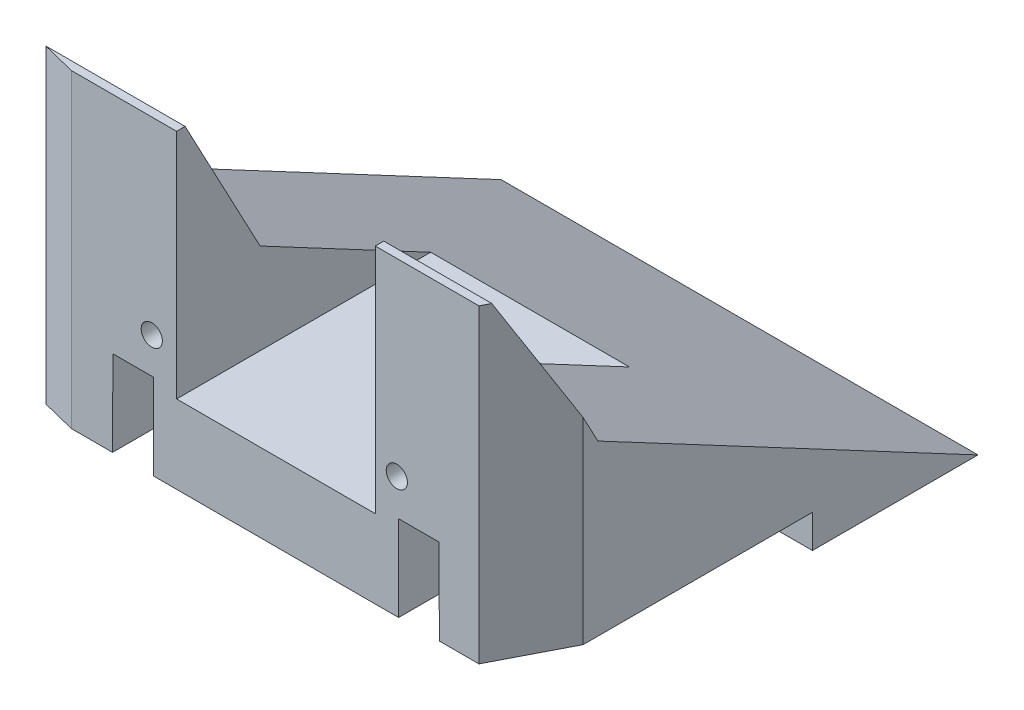
ISO-10303-21;
HEADER;
FILE_DESCRIPTION(('STEP AP214'),'2;1');
FILE_NAME('part.step','',(''),(''),'','','');
FILE_SCHEMA(('AUTOMOTIVE_DESIGN { 1 0 10303 214 1 1 1 1 }'));
ENDSEC;
DATA;
#1=APPLICATION_CONTEXT('core data for automotive mechanical design processes');
#2=APPLICATION_PROTOCOL_DEFINITION('international standard','automotive_design',2000,#1);
#3=PRODUCT_CONTEXT('',#1,'mechanical');
#4=PRODUCT('Part','Part','',(#3));
#5=PRODUCT_RELATED_PRODUCT_CATEGORY('part','',(#4));
#6=PRODUCT_DEFINITION_FORMATION('','',#4);
#7=PRODUCT_DEFINITION_CONTEXT('part definition',#1,'design');
#8=PRODUCT_DEFINITION('design','',#6,#7);
#9=PRODUCT_DEFINITION_SHAPE('','',#8);
#10=(LENGTH_UNIT() NAMED_UNIT(*) SI_UNIT(.MILLI.,.METRE.));
#11=(NAMED_UNIT(*) PLANE_ANGLE_UNIT() SI_UNIT($,.RADIAN.));
#12=(NAMED_UNIT(*) SI_UNIT($,.STERADIAN.) SOLID_ANGLE_UNIT());
#13=UNCERTAINTY_MEASURE_WITH_UNIT(LENGTH_MEASURE(1.E-05),#10,'distance_accuracy_value','');
#14=(GEOMETRIC_REPRESENTATION_CONTEXT(3) GLOBAL_UNCERTAINTY_ASSIGNED_CONTEXT((#13)) GLOBAL_UNIT_ASSIGNED_CONTEXT((#10,
#11,#12)) REPRESENTATION_CONTEXT('',''));
#15=CARTESIAN_POINT('',(0.,0.,0.));
#16=DIRECTION('',(0.,0.,1.));
#17=DIRECTION('',(1.,0.,0.));
#18=AXIS2_PLACEMENT_3D('',#15,#16,#17);
#19=CARTESIAN_POINT('',(72.,51.82,0.));
#20=DIRECTION('',(0.,-1.,0.));
#21=DIRECTION('',(0.,0.,-1.));
#22=AXIS2_PLACEMENT_3D('',#19,#20,#21);
#23=PLANE('',#22);
#24=DIRECTION('',(-1.,0.,0.));
#25=VECTOR('',#24,1.);
#26=CARTESIAN_POINT('',(72.,51.82,0.));
#27=LINE('',#26,#25);
#28=CARTESIAN_POINT('',(66.648328853148,51.82,0.));
#29=VERTEX_POINT('',#28);
#30=CARTESIAN_POINT('',(51.,51.82,0.));
#31=VERTEX_POINT('',#30);
#32=EDGE_CURVE('E411',#29,#31,#27,.T.);
#33=ORIENTED_EDGE('',*,*,#32,.F.);
#34=DIRECTION('',(-0.458155006495583,0.,0.88887231367786));
#35=VECTOR('',#34,1.);
#36=CARTESIAN_POINT('',(66.648328853148,51.82,0.));
#37=LINE('',#36,#35);
#38=CARTESIAN_POINT('',(67.3084366509914,51.82,-1.28068347442915));
#39=VERTEX_POINT('',#38);
#40=EDGE_CURVE('E325',#39,#29,#37,.T.);
#41=ORIENTED_EDGE('',*,*,#40,.F.);
#42=DIRECTION('',(1.,0.,0.));
#43=VECTOR('',#42,1.);
#44=CARTESIAN_POINT('',(0.,51.82,-1.28068347442915));
#45=LINE('',#44,#43);
#46=CARTESIAN_POINT('',(51.,51.82,-1.28068347442915));
#47=VERTEX_POINT('',#46);
#48=EDGE_CURVE('E403',#47,#39,#45,.T.);
#49=ORIENTED_EDGE('',*,*,#48,.F.);
#50=DIRECTION('',(0.,0.,-1.));
#51=VECTOR('',#50,1.);
#52=CARTESIAN_POINT('',(51.,51.82,0.));
#53=LINE('',#52,#51);
#54=EDGE_CURVE('E359',#31,#47,#53,.T.);
#55=ORIENTED_EDGE('',*,*,#54,.F.);
#56=EDGE_LOOP('',(#33,#41,#49,#55));
#57=FACE_BOUND('',#56,.T.);
#58=ADVANCED_FACE('F33',(#57),#23,.F.);
#59=CARTESIAN_POINT('',(0.,30.515651581083,-12.6084064641698));
#60=DIRECTION('',(0.,-0.469471562785895,0.882947592858924));
#61=DIRECTION('',(0.,-0.882947592858925,-0.469471562785895));
#62=AXIS2_PLACEMENT_3D('',#59,#60,#61);
#63=PLANE('',#62);
#64=ORIENTED_EDGE('',*,*,#48,.T.);
#65=DIRECTION('',(-0.235193662382154,0.858179613223027,0.456302194410289));
#66=VECTOR('',#65,1.);
#67=CARTESIAN_POINT('',(77.5939479758121,14.2900085829974,-21.235733881024));
#68=LINE('',#67,#66);
#69=CARTESIAN_POINT('',(72.,34.7013243542187,-10.3828447728448));
#70=VERTEX_POINT('',#69);
#71=EDGE_CURVE('E315',#70,#39,#68,.T.);
#72=ORIENTED_EDGE('',*,*,#71,.F.);
#73=DIRECTION('',(0.,-0.882947592858925,-0.469471562785895));
#74=VECTOR('',#73,1.);
#75=CARTESIAN_POINT('',(72.,30.515651581083,-12.6084064641698));
#76=LINE('',#75,#74);
#77=CARTESIAN_POINT('',(72.,30.515651581083,-12.6084064641698));
#78=VERTEX_POINT('',#77);
#79=EDGE_CURVE('E387',#70,#78,#76,.T.);
#80=ORIENTED_EDGE('',*,*,#79,.T.);
#81=DIRECTION('',(1.,0.,0.));
#82=VECTOR('',#81,1.);
#83=CARTESIAN_POINT('',(0.,30.515651581083,-12.6084064641698));
#84=LINE('',#83,#82);
#85=CARTESIAN_POINT('',(51.,30.515651581083,-12.6084064641698));
#86=VERTEX_POINT('',#85);
#87=EDGE_CURVE('E395',#86,#78,#84,.T.);
#88=ORIENTED_EDGE('',*,*,#87,.F.);
#89=DIRECTION('',(0.,0.882947592858925,0.469471562785895));
#90=VECTOR('',#89,1.);
#91=CARTESIAN_POINT('',(51.,30.515651581083,-12.6084064641698));
#92=LINE('',#91,#90);
#93=EDGE_CURVE('E384',#86,#47,#92,.T.);
#94=ORIENTED_EDGE('',*,*,#93,.T.);
#95=EDGE_LOOP('',(#64,#72,#80,#88,#94));
#96=FACE_BOUND('',#95,.T.);
#97=ADVANCED_FACE('F487',(#96),#63,.F.);
#98=CARTESIAN_POINT('',(72.,0.,0.));
#99=DIRECTION('',(0.,0.,-1.));
#100=DIRECTION('',(-1.,0.,0.));
#101=AXIS2_PLACEMENT_3D('',#98,#99,#100);
#102=PLANE('',#101);
#103=CARTESIAN_POINT('',(17.2500000000013,23.320000000001,0.));
#104=DIRECTION('',(0.,0.,1.));
#105=DIRECTION('',(1.,0.,0.));
#106=AXIS2_PLACEMENT_3D('',#103,#104,#105);
#107=CIRCLE('',#106,1.6);
#108=CARTESIAN_POINT('',(18.8500000000013,23.320000000001,0.));
#109=VERTEX_POINT('',#108);
#110=EDGE_CURVE('E316',#109,#109,#107,.T.);
#111=ORIENTED_EDGE('',*,*,#110,.F.);
#112=EDGE_LOOP('',(#111));
#113=FACE_BOUND('',#112,.T.);
#114=CARTESIAN_POINT('',(54.2500000000013,23.3200000000008,0.));
#115=DIRECTION('',(0.,0.,1.));
#116=DIRECTION('',(1.,0.,0.));
#117=AXIS2_PLACEMENT_3D('',#114,#115,#116);
#118=CIRCLE('',#117,1.6);
#119=CARTESIAN_POINT('',(55.8500000000013,23.3200000000008,0.));
#120=VERTEX_POINT('',#119);
#121=EDGE_CURVE('E309',#120,#120,#118,.T.);
#122=ORIENTED_EDGE('',*,*,#121,.F.);
#123=EDGE_LOOP('',(#122));
#124=FACE_BOUND('',#123,.T.);
#125=DIRECTION('',(-1.,0.,0.));
#126=VECTOR('',#125,1.);
#127=CARTESIAN_POINT('',(54.521671146852,17.92,0.));
#128=LINE('',#127,#126);
#129=CARTESIAN_POINT('',(60.621671146852,17.92,0.));
#130=VERTEX_POINT('',#129);
#131=CARTESIAN_POINT('',(54.521671146852,17.92,0.));
#132=VERTEX_POINT('',#131);
#133=EDGE_CURVE('E232',#130,#132,#128,.T.);
#134=ORIENTED_EDGE('',*,*,#133,.F.);
#135=DIRECTION('',(-0.00386994006096731,0.999992511753925,0.));
#136=VECTOR('',#135,1.);
#137=CARTESIAN_POINT('',(60.621671146852,17.92,0.));
#138=LINE('',#137,#136);
#139=CARTESIAN_POINT('',(60.671671146852,5.,0.));
#140=VERTEX_POINT('',#139);
#141=EDGE_CURVE('E217',#140,#130,#138,.T.);
#142=ORIENTED_EDGE('',*,*,#141,.F.);
#143=DIRECTION('',(1.,0.,0.));
#144=VECTOR('',#143,1.);
#145=CARTESIAN_POINT('',(-0.001000000000001,5.,0.));
#146=LINE('',#145,#144);
#147=CARTESIAN_POINT('',(66.648328853148,5.,0.));
#148=VERTEX_POINT('',#147);
#149=EDGE_CURVE('E361',#140,#148,#146,.T.);
#150=ORIENTED_EDGE('',*,*,#149,.T.);
#151=DIRECTION('',(0.,1.,0.));
#152=VECTOR('',#151,1.);
#153=CARTESIAN_POINT('',(66.648328853148,-0.001000000000001,0.));
#154=LINE('',#153,#152);
#155=EDGE_CURVE('E328',#148,#29,#154,.T.);
#156=ORIENTED_EDGE('',*,*,#155,.T.);
#157=ORIENTED_EDGE('',*,*,#32,.T.);
#158=DIRECTION('',(0.,1.,0.));
#159=VECTOR('',#158,1.);
#160=CARTESIAN_POINT('',(51.,16.82,0.));
#161=LINE('',#160,#159);
#162=CARTESIAN_POINT('',(51.,16.82,0.));
#163=VERTEX_POINT('',#162);
#164=EDGE_CURVE('E376',#163,#31,#161,.T.);
#165=ORIENTED_EDGE('',*,*,#164,.F.);
#166=DIRECTION('',(1.,0.,0.));
#167=VECTOR('',#166,1.);
#168=CARTESIAN_POINT('',(51.,16.82,0.));
#169=LINE('',#168,#167);
#170=CARTESIAN_POINT('',(21.,16.82,0.));
#171=VERTEX_POINT('',#170);
#172=EDGE_CURVE('E370',#171,#163,#169,.T.);
#173=ORIENTED_EDGE('',*,*,#172,.F.);
#174=DIRECTION('',(0.,1.,0.));
#175=VECTOR('',#174,1.);
#176=CARTESIAN_POINT('',(21.,16.82,0.));
#177=LINE('',#176,#175);
#178=CARTESIAN_POINT('',(21.,51.82,0.));
#179=VERTEX_POINT('',#178);
#180=EDGE_CURVE('E373',#171,#179,#177,.T.);
#181=ORIENTED_EDGE('',*,*,#180,.T.);
#182=CARTESIAN_POINT('',(5.10343225958013,51.82,0.));
#183=VERTEX_POINT('',#182);
#184=EDGE_CURVE('E409',#179,#183,#27,.T.);
#185=ORIENTED_EDGE('',*,*,#184,.T.);
#186=DIRECTION('',(0.,1.,0.));
#187=VECTOR('',#186,1.);
#188=CARTESIAN_POINT('',(5.10343225958013,-0.001000000000001,0.));
#189=LINE('',#188,#187);
#190=CARTESIAN_POINT('',(5.10343225958013,5.,0.));
#191=VERTEX_POINT('',#190);
#192=EDGE_CURVE('E338',#191,#183,#189,.T.);
#193=ORIENTED_EDGE('',*,*,#192,.F.);
#194=CARTESIAN_POINT('',(11.328328853148,5.,0.));
#195=VERTEX_POINT('',#194);
#196=EDGE_CURVE('E356',#191,#195,#146,.T.);
#197=ORIENTED_EDGE('',*,*,#196,.T.);
#198=DIRECTION('',(-0.00386994006096731,-0.999992511753925,0.));
#199=VECTOR('',#198,1.);
#200=CARTESIAN_POINT('',(11.378328853148,17.92,0.));
#201=LINE('',#200,#199);
#202=CARTESIAN_POINT('',(11.378328853148,17.92,0.));
#203=VERTEX_POINT('',#202);
#204=EDGE_CURVE('E246',#203,#195,#201,.T.);
#205=ORIENTED_EDGE('',*,*,#204,.F.);
#206=DIRECTION('',(-1.,0.,0.));
#207=VECTOR('',#206,1.);
#208=CARTESIAN_POINT('',(17.478328853148,17.92,0.));
#209=LINE('',#208,#207);
#210=CARTESIAN_POINT('',(17.478328853148,17.92,0.));
#211=VERTEX_POINT('',#210);
#212=EDGE_CURVE('E255',#211,#203,#209,.T.);
#213=ORIENTED_EDGE('',*,*,#212,.F.);
#214=DIRECTION('',(0.,1.,0.));
#215=VECTOR('',#214,1.);
#216=CARTESIAN_POINT('',(17.478328853148,17.92,0.));
#217=LINE('',#216,#215);
#218=CARTESIAN_POINT('',(17.478328853148,5.,0.));
#219=VERTEX_POINT('',#218);
#220=EDGE_CURVE('E252',#219,#211,#217,.T.);
#221=ORIENTED_EDGE('',*,*,#220,.F.);
#222=CARTESIAN_POINT('',(54.521671146852,5.,0.));
#223=VERTEX_POINT('',#222);
#224=EDGE_CURVE('E360',#219,#223,#146,.T.);
#225=ORIENTED_EDGE('',*,*,#224,.T.);
#226=DIRECTION('',(0.,-1.,0.));
#227=VECTOR('',#226,1.);
#228=CARTESIAN_POINT('',(54.521671146852,17.92,0.));
#229=LINE('',#228,#227);
#230=EDGE_CURVE('E211',#132,#223,#229,.T.);
#231=ORIENTED_EDGE('',*,*,#230,.F.);
#232=EDGE_LOOP('',(#134,#142,#150,#156,#157,#165,#173,#181,#185,#193,#197,#205,#213,#221,#225,#231));
#233=FACE_BOUND('',#232,.T.);
#234=ADVANCED_FACE('F35',(#113,#124,#233),#102,.F.);
#235=CARTESIAN_POINT('',(72.,0.,0.));
#236=DIRECTION('',(0.,1.,0.));
#237=DIRECTION('',(0.,0.,1.));
#238=AXIS2_PLACEMENT_3D('',#235,#236,#237);
#239=PLANE('',#238);
#240=DIRECTION('',(0.,0.,-1.));
#241=VECTOR('',#240,1.);
#242=CARTESIAN_POINT('',(72.,0.,0.));
#243=LINE('',#242,#241);
#244=CARTESIAN_POINT('',(72.,0.,-45.));
#245=VERTEX_POINT('',#244);
#246=CARTESIAN_POINT('',(72.,0.,-70.));
#247=VERTEX_POINT('',#246);
#248=EDGE_CURVE('E407',#245,#247,#243,.T.);
#249=ORIENTED_EDGE('',*,*,#248,.F.);
#250=DIRECTION('',(1.,0.,0.));
#251=VECTOR('',#250,1.);
#252=CARTESIAN_POINT('',(-0.001000000000001,0.,-45.));
#253=LINE('',#252,#251);
#254=CARTESIAN_POINT('',(0.,0.,-45.));
#255=VERTEX_POINT('',#254);
#256=EDGE_CURVE('E355',#255,#245,#253,.T.);
#257=ORIENTED_EDGE('',*,*,#256,.F.);
#258=DIRECTION('',(0.,0.,-1.));
#259=VECTOR('',#258,1.);
#260=CARTESIAN_POINT('',(0.,0.,0.));
#261=LINE('',#260,#259);
#262=CARTESIAN_POINT('',(0.,0.,-70.));
#263=VERTEX_POINT('',#262);
#264=EDGE_CURVE('E402',#255,#263,#261,.T.);
#265=ORIENTED_EDGE('',*,*,#264,.T.);
#266=DIRECTION('',(-1.,0.,0.));
#267=VECTOR('',#266,1.);
#268=CARTESIAN_POINT('',(72.,0.,-70.));
#269=LINE('',#268,#267);
#270=EDGE_CURVE('E413',#247,#263,#269,.T.);
#271=ORIENTED_EDGE('',*,*,#270,.F.);
#272=EDGE_LOOP('',(#249,#257,#265,#271));
#273=FACE_BOUND('',#272,.T.);
#274=ADVANCED_FACE('F471',(#273),#239,.F.);
#275=CARTESIAN_POINT('',(0.,51.82,-1.28068347442915));
#276=VERTEX_POINT('',#275);
#277=CARTESIAN_POINT('',(21.,51.82,-1.28068347442915));
#278=VERTEX_POINT('',#277);
#279=EDGE_CURVE('E399',#276,#278,#45,.T.);
#280=ORIENTED_EDGE('',*,*,#279,.F.);
#281=DIRECTION('',(-0.969926330980672,0.,-0.243398669820464));
#282=VECTOR('',#281,1.);
#283=CARTESIAN_POINT('',(5.10343225958013,51.82,0.));
#284=LINE('',#283,#282);
#285=EDGE_CURVE('E336',#183,#276,#284,.T.);
#286=ORIENTED_EDGE('',*,*,#285,.F.);
#287=ORIENTED_EDGE('',*,*,#184,.F.);
#288=DIRECTION('',(0.,0.,1.));
#289=VECTOR('',#288,1.);
#290=CARTESIAN_POINT('',(21.,51.82,0.));
#291=LINE('',#290,#289);
#292=EDGE_CURVE('E368',#278,#179,#291,.T.);
#293=ORIENTED_EDGE('',*,*,#292,.F.);
#294=EDGE_LOOP('',(#280,#286,#287,#293));
#295=FACE_BOUND('',#294,.T.);
#296=ADVANCED_FACE('F514',(#295),#23,.F.);
#297=CARTESIAN_POINT('',(72.,0.,0.));
#298=DIRECTION('',(-1.,0.,0.));
#299=DIRECTION('',(0.,0.,1.));
#300=AXIS2_PLACEMENT_3D('',#297,#298,#299);
#301=PLANE('',#300);
#302=ORIENTED_EDGE('',*,*,#79,.F.);
#303=DIRECTION('',(0.,1.,0.));
#304=VECTOR('',#303,1.);
#305=CARTESIAN_POINT('',(72.,-0.001000000000001,-10.3828447728448));
#306=LINE('',#305,#304);
#307=CARTESIAN_POINT('',(72.,5.,-10.3828447728448));
#308=VERTEX_POINT('',#307);
#309=EDGE_CURVE('E327',#308,#70,#306,.T.);
#310=ORIENTED_EDGE('',*,*,#309,.F.);
#311=DIRECTION('',(0.,0.,1.));
#312=VECTOR('',#311,1.);
#313=CARTESIAN_POINT('',(72.,5.,0.));
#314=LINE('',#313,#312);
#315=CARTESIAN_POINT('',(72.,5.,-45.));
#316=VERTEX_POINT('',#315);
#317=EDGE_CURVE('E352',#316,#308,#314,.T.);
#318=ORIENTED_EDGE('',*,*,#317,.F.);
#319=DIRECTION('',(0.,1.,0.));
#320=VECTOR('',#319,1.);
#321=CARTESIAN_POINT('',(72.,0.,-45.));
#322=LINE('',#321,#320);
#323=EDGE_CURVE('E349',#245,#316,#322,.T.);
#324=ORIENTED_EDGE('',*,*,#323,.F.);
#325=ORIENTED_EDGE('',*,*,#248,.T.);
#326=DIRECTION('',(0.,-0.469471562785892,-0.882947592858926));
#327=VECTOR('',#326,1.);
#328=CARTESIAN_POINT('',(72.,30.515651581083,-12.6084064641698));
#329=LINE('',#328,#327);
#330=EDGE_CURVE('E392',#78,#247,#329,.T.);
#331=ORIENTED_EDGE('',*,*,#330,.F.);
#332=EDGE_LOOP('',(#302,#310,#318,#324,#325,#331));
#333=FACE_BOUND('',#332,.T.);
#334=ADVANCED_FACE('F476',(#333),#301,.F.);
#335=CARTESIAN_POINT('',(0.,0.,0.));
#336=DIRECTION('',(-1.,0.,0.));
#337=DIRECTION('',(0.,0.,1.));
#338=AXIS2_PLACEMENT_3D('',#335,#336,#337);
#339=PLANE('',#338);
#340=DIRECTION('',(0.,1.,0.));
#341=VECTOR('',#340,1.);
#342=CARTESIAN_POINT('',(0.,-0.001000000000001,-1.28068347442915));
#343=LINE('',#342,#341);
#344=CARTESIAN_POINT('',(0.,5.,-1.28068347442915));
#345=VERTEX_POINT('',#344);
#346=EDGE_CURVE('E339',#345,#276,#343,.T.);
#347=ORIENTED_EDGE('',*,*,#346,.T.);
#348=DIRECTION('',(0.,-0.882947592858925,-0.469471562785895));
#349=VECTOR('',#348,1.);
#350=CARTESIAN_POINT('',(0.,30.515651581083,-12.6084064641698));
#351=LINE('',#350,#349);
#352=CARTESIAN_POINT('',(0.,30.515651581083,-12.6084064641698));
#353=VERTEX_POINT('',#352);
#354=EDGE_CURVE('E388',#276,#353,#351,.T.);
#355=ORIENTED_EDGE('',*,*,#354,.T.);
#356=DIRECTION('',(0.,-0.469471562785892,-0.882947592858926));
#357=VECTOR('',#356,1.);
#358=CARTESIAN_POINT('',(0.,30.515651581083,-12.6084064641698));
#359=LINE('',#358,#357);
#360=EDGE_CURVE('E391',#353,#263,#359,.T.);
#361=ORIENTED_EDGE('',*,*,#360,.T.);
#362=ORIENTED_EDGE('',*,*,#264,.F.);
#363=DIRECTION('',(0.,1.,0.));
#364=VECTOR('',#363,1.);
#365=CARTESIAN_POINT('',(0.,0.,-45.));
#366=LINE('',#365,#364);
#367=CARTESIAN_POINT('',(0.,5.,-45.));
#368=VERTEX_POINT('',#367);
#369=EDGE_CURVE('E342',#255,#368,#366,.T.);
#370=ORIENTED_EDGE('',*,*,#369,.T.);
#371=DIRECTION('',(0.,0.,1.));
#372=VECTOR('',#371,1.);
#373=CARTESIAN_POINT('',(0.,5.,0.));
#374=LINE('',#373,#372);
#375=EDGE_CURVE('E346',#368,#345,#374,.T.);
#376=ORIENTED_EDGE('',*,*,#375,.T.);
#377=EDGE_LOOP('',(#347,#355,#361,#362,#370,#376));
#378=FACE_BOUND('',#377,.T.);
#379=ADVANCED_FACE('F462',(#378),#339,.T.);
#380=ORIENTED_EDGE('',*,*,#279,.T.);
#381=DIRECTION('',(0.,-0.882947592858925,-0.469471562785895));
#382=VECTOR('',#381,1.);
#383=CARTESIAN_POINT('',(21.,30.515651581083,-12.6084064641698));
#384=LINE('',#383,#382);
#385=CARTESIAN_POINT('',(21.,30.515651581083,-12.6084064641698));
#386=VERTEX_POINT('',#385);
#387=EDGE_CURVE('E379',#278,#386,#384,.T.);
#388=ORIENTED_EDGE('',*,*,#387,.T.);
#389=EDGE_CURVE('E404',#353,#386,#84,.T.);
#390=ORIENTED_EDGE('',*,*,#389,.F.);
#391=ORIENTED_EDGE('',*,*,#354,.F.);
#392=EDGE_LOOP('',(#380,#388,#390,#391));
#393=FACE_BOUND('',#392,.T.);
#394=ADVANCED_FACE('F517',(#393),#63,.F.);
#395=CARTESIAN_POINT('',(0.,30.515651581083,-12.6084064641698));
#396=DIRECTION('',(0.,-0.882947592858926,0.469471562785892));
#397=DIRECTION('',(0.,-0.469471562785892,-0.882947592858926));
#398=AXIS2_PLACEMENT_3D('',#395,#396,#397);
#399=PLANE('',#398);
#400=DIRECTION('',(-1.,0.,0.));
#401=VECTOR('',#400,1.);
#402=CARTESIAN_POINT('',(0.,16.82,-38.3661808528748));
#403=LINE('',#402,#401);
#404=CARTESIAN_POINT('',(51.,16.82,-38.3661808528748));
#405=VERTEX_POINT('',#404);
#406=CARTESIAN_POINT('',(21.,16.82,-38.3661808528748));
#407=VERTEX_POINT('',#406);
#408=EDGE_CURVE('E416',#405,#407,#403,.T.);
#409=ORIENTED_EDGE('',*,*,#408,.F.);
#410=DIRECTION('',(0.,0.469471562785892,0.882947592858926));
#411=VECTOR('',#410,1.);
#412=CARTESIAN_POINT('',(51.,30.515651581083,-12.6084064641698));
#413=LINE('',#412,#411);
#414=EDGE_CURVE('E421',#405,#86,#413,.T.);
#415=ORIENTED_EDGE('',*,*,#414,.T.);
#416=ORIENTED_EDGE('',*,*,#87,.T.);
#417=ORIENTED_EDGE('',*,*,#330,.T.);
#418=ORIENTED_EDGE('',*,*,#270,.T.);
#419=ORIENTED_EDGE('',*,*,#360,.F.);
#420=ORIENTED_EDGE('',*,*,#389,.T.);
#421=DIRECTION('',(0.,-0.469471562785892,-0.882947592858926));
#422=VECTOR('',#421,1.);
#423=CARTESIAN_POINT('',(21.,30.515651581083,-12.6084064641698));
#424=LINE('',#423,#422);
#425=EDGE_CURVE('E418',#386,#407,#424,.T.);
#426=ORIENTED_EDGE('',*,*,#425,.T.);
#427=EDGE_LOOP('',(#409,#415,#416,#417,#418,#419,#420,#426));
#428=FACE_BOUND('',#427,.T.);
#429=ADVANCED_FACE('F481',(#428),#399,.F.);
#430=CARTESIAN_POINT('',(51.,16.82,0.));
#431=DIRECTION('',(1.,0.,0.));
#432=DIRECTION('',(0.,0.,-1.));
#433=AXIS2_PLACEMENT_3D('',#430,#431,#432);
#434=PLANE('',#433);
#435=ORIENTED_EDGE('',*,*,#414,.F.);
#436=DIRECTION('',(0.,0.,-1.));
#437=VECTOR('',#436,1.);
#438=CARTESIAN_POINT('',(51.,16.82,0.));
#439=LINE('',#438,#437);
#440=EDGE_CURVE('E365',#163,#405,#439,.T.);
#441=ORIENTED_EDGE('',*,*,#440,.F.);
#442=ORIENTED_EDGE('',*,*,#164,.T.);
#443=ORIENTED_EDGE('',*,*,#54,.T.);
#444=ORIENTED_EDGE('',*,*,#93,.F.);
#445=EDGE_LOOP('',(#435,#441,#442,#443,#444));
#446=FACE_BOUND('',#445,.T.);
#447=ADVANCED_FACE('F502',(#446),#434,.F.);
#448=CARTESIAN_POINT('',(21.,16.82,0.));
#449=DIRECTION('',(-1.,0.,0.));
#450=DIRECTION('',(0.,0.,1.));
#451=AXIS2_PLACEMENT_3D('',#448,#449,#450);
#452=PLANE('',#451);
#453=ORIENTED_EDGE('',*,*,#292,.T.);
#454=ORIENTED_EDGE('',*,*,#180,.F.);
#455=DIRECTION('',(0.,0.,1.));
#456=VECTOR('',#455,1.);
#457=CARTESIAN_POINT('',(21.,16.82,0.));
#458=LINE('',#457,#456);
#459=EDGE_CURVE('E367',#407,#171,#458,.T.);
#460=ORIENTED_EDGE('',*,*,#459,.F.);
#461=ORIENTED_EDGE('',*,*,#425,.F.);
#462=ORIENTED_EDGE('',*,*,#387,.F.);
#463=EDGE_LOOP('',(#453,#454,#460,#461,#462));
#464=FACE_BOUND('',#463,.T.);
#465=ADVANCED_FACE('F510',(#464),#452,.F.);
#466=CARTESIAN_POINT('',(0.,16.82,0.));
#467=DIRECTION('',(0.,1.,0.));
#468=DIRECTION('',(0.,0.,1.));
#469=AXIS2_PLACEMENT_3D('',#466,#467,#468);
#470=PLANE('',#469);
#471=ORIENTED_EDGE('',*,*,#408,.T.);
#472=ORIENTED_EDGE('',*,*,#459,.T.);
#473=ORIENTED_EDGE('',*,*,#172,.T.);
#474=ORIENTED_EDGE('',*,*,#440,.T.);
#475=EDGE_LOOP('',(#471,#472,#473,#474));
#476=FACE_BOUND('',#475,.T.);
#477=ADVANCED_FACE('F507',(#476),#470,.T.);
#478=CARTESIAN_POINT('',(-0.001000000000001,5.,0.));
#479=DIRECTION('',(0.,1.,0.));
#480=DIRECTION('',(0.,0.,1.));
#481=AXIS2_PLACEMENT_3D('',#478,#479,#480);
#482=PLANE('',#481);
#483=CARTESIAN_POINT('',(36.,5.,-35.));
#484=DIRECTION('',(0.,-1.,0.));
#485=DIRECTION('',(0.,0.,-1.));
#486=AXIS2_PLACEMENT_3D('',#483,#484,#485);
#487=CIRCLE('',#486,2.5);
#488=CARTESIAN_POINT('',(36.,5.,-37.5));
#489=VERTEX_POINT('',#488);
#490=EDGE_CURVE('E279',#489,#489,#487,.T.);
#491=ORIENTED_EDGE('',*,*,#490,.F.);
#492=EDGE_LOOP('',(#491));
#493=FACE_BOUND('',#492,.T.);
#494=ORIENTED_EDGE('',*,*,#149,.F.);
#495=DIRECTION('',(0.,0.,1.));
#496=VECTOR('',#495,1.);
#497=CARTESIAN_POINT('',(60.671671146852,5.,-10.));
#498=LINE('',#497,#496);
#499=CARTESIAN_POINT('',(60.671671146852,5.,-8.86068333730502));
#500=VERTEX_POINT('',#499);
#501=EDGE_CURVE('E236',#500,#140,#498,.T.);
#502=ORIENTED_EDGE('',*,*,#501,.F.);
#503=CARTESIAN_POINT('',(62.,5.,-10.));
#504=DIRECTION('',(0.,-1.,0.));
#505=DIRECTION('',(0.,0.,-1.));
#506=AXIS2_PLACEMENT_3D('',#503,#504,#505);
#507=CIRCLE('',#506,1.74999999999999);
#508=CARTESIAN_POINT('',(60.25,5.,-10.));
#509=VERTEX_POINT('',#508);
#510=EDGE_CURVE('E286',#509,#500,#507,.T.);
#511=ORIENTED_EDGE('',*,*,#510,.F.);
#512=DIRECTION('',(1.,0.,0.));
#513=VECTOR('',#512,1.);
#514=CARTESIAN_POINT('',(60.671671146852,5.,-10.));
#515=LINE('',#514,#513);
#516=CARTESIAN_POINT('',(54.521671146852,5.,-10.));
#517=VERTEX_POINT('',#516);
#518=EDGE_CURVE('E222',#517,#509,#515,.T.);
#519=ORIENTED_EDGE('',*,*,#518,.F.);
#520=DIRECTION('',(0.,0.,1.));
#521=VECTOR('',#520,1.);
#522=CARTESIAN_POINT('',(54.521671146852,5.,-10.));
#523=LINE('',#522,#521);
#524=EDGE_CURVE('E238',#517,#223,#523,.T.);
#525=ORIENTED_EDGE('',*,*,#524,.T.);
#526=ORIENTED_EDGE('',*,*,#224,.F.);
#527=DIRECTION('',(0.,0.,1.));
#528=VECTOR('',#527,1.);
#529=CARTESIAN_POINT('',(17.478328853148,5.,-10.));
#530=LINE('',#529,#528);
#531=CARTESIAN_POINT('',(17.478328853148,5.,-10.));
#532=VERTEX_POINT('',#531);
#533=EDGE_CURVE('E233',#532,#219,#530,.T.);
#534=ORIENTED_EDGE('',*,*,#533,.F.);
#535=DIRECTION('',(1.,0.,0.));
#536=VECTOR('',#535,1.);
#537=CARTESIAN_POINT('',(11.328328853148,5.,-10.));
#538=LINE('',#537,#536);
#539=CARTESIAN_POINT('',(11.75,5.,-10.));
#540=VERTEX_POINT('',#539);
#541=EDGE_CURVE('E249',#540,#532,#538,.T.);
#542=ORIENTED_EDGE('',*,*,#541,.F.);
#543=CARTESIAN_POINT('',(10.,5.,-10.));
#544=DIRECTION('',(0.,-1.,0.));
#545=DIRECTION('',(0.,0.,-1.));
#546=AXIS2_PLACEMENT_3D('',#543,#544,#545);
#547=CIRCLE('',#546,1.75);
#548=CARTESIAN_POINT('',(11.328328853148,5.,-8.86068333730501));
#549=VERTEX_POINT('',#548);
#550=EDGE_CURVE('E298',#549,#540,#547,.T.);
#551=ORIENTED_EDGE('',*,*,#550,.F.);
#552=DIRECTION('',(0.,0.,1.));
#553=VECTOR('',#552,1.);
#554=CARTESIAN_POINT('',(11.328328853148,5.,-10.));
#555=LINE('',#554,#553);
#556=EDGE_CURVE('E260',#549,#195,#555,.T.);
#557=ORIENTED_EDGE('',*,*,#556,.T.);
#558=ORIENTED_EDGE('',*,*,#196,.F.);
#559=DIRECTION('',(0.969926330980672,0.,0.243398669820464));
#560=VECTOR('',#559,1.);
#561=CARTESIAN_POINT('',(5.10343225958013,5.,0.));
#562=LINE('',#561,#560);
#563=EDGE_CURVE('E334',#345,#191,#562,.T.);
#564=ORIENTED_EDGE('',*,*,#563,.F.);
#565=ORIENTED_EDGE('',*,*,#375,.F.);
#566=DIRECTION('',(1.,0.,0.));
#567=VECTOR('',#566,1.);
#568=CARTESIAN_POINT('',(-0.001000000000001,5.,-45.));
#569=LINE('',#568,#567);
#570=EDGE_CURVE('E362',#368,#316,#569,.T.);
#571=ORIENTED_EDGE('',*,*,#570,.T.);
#572=ORIENTED_EDGE('',*,*,#317,.T.);
#573=DIRECTION('',(0.458155006495584,0.,-0.88887231367786));
#574=VECTOR('',#573,1.);
#575=CARTESIAN_POINT('',(66.648328853148,5.,0.));
#576=LINE('',#575,#574);
#577=EDGE_CURVE('E331',#148,#308,#576,.T.);
#578=ORIENTED_EDGE('',*,*,#577,.F.);
#579=EDGE_LOOP('',(#494,#502,#511,#519,#525,#526,#534,#542,#551,#557,#558,#564,#565,#571,#572,#578));
#580=FACE_BOUND('',#579,.T.);
#581=CARTESIAN_POINT('',(62.,5.,-35.));
#582=DIRECTION('',(0.,-1.,0.));
#583=DIRECTION('',(0.,0.,-1.));
#584=AXIS2_PLACEMENT_3D('',#581,#582,#583);
#585=CIRCLE('',#584,1.74999999999999);
#586=CARTESIAN_POINT('',(62.,5.,-36.75));
#587=VERTEX_POINT('',#586);
#588=EDGE_CURVE('E285',#587,#587,#585,.T.);
#589=ORIENTED_EDGE('',*,*,#588,.F.);
#590=EDGE_LOOP('',(#589));
#591=FACE_BOUND('',#590,.T.);
#592=CARTESIAN_POINT('',(36.,5.,-10.));
#593=DIRECTION('',(0.,-1.,0.));
#594=DIRECTION('',(0.,0.,-1.));
#595=AXIS2_PLACEMENT_3D('',#592,#593,#594);
#596=CIRCLE('',#595,2.5);
#597=CARTESIAN_POINT('',(36.,5.,-12.5));
#598=VERTEX_POINT('',#597);
#599=EDGE_CURVE('E275',#598,#598,#596,.T.);
#600=ORIENTED_EDGE('',*,*,#599,.F.);
#601=EDGE_LOOP('',(#600));
#602=FACE_BOUND('',#601,.T.);
#603=CARTESIAN_POINT('',(10.,5.,-35.));
#604=DIRECTION('',(0.,-1.,0.));
#605=DIRECTION('',(0.,0.,-1.));
#606=AXIS2_PLACEMENT_3D('',#603,#604,#605);
#607=CIRCLE('',#606,1.75);
#608=CARTESIAN_POINT('',(10.,5.,-36.75));
#609=VERTEX_POINT('',#608);
#610=EDGE_CURVE('E297',#609,#609,#607,.T.);
#611=ORIENTED_EDGE('',*,*,#610,.F.);
#612=EDGE_LOOP('',(#611));
#613=FACE_BOUND('',#612,.T.);
#614=ADVANCED_FACE('F439',(#493,#580,#591,#602,#613),#482,.F.);
#615=CARTESIAN_POINT('',(-0.001000000000001,0.,-45.));
#616=DIRECTION('',(0.,0.,-1.));
#617=DIRECTION('',(-1.,0.,0.));
#618=AXIS2_PLACEMENT_3D('',#615,#616,#617);
#619=PLANE('',#618);
#620=ORIENTED_EDGE('',*,*,#256,.T.);
#621=ORIENTED_EDGE('',*,*,#323,.T.);
#622=ORIENTED_EDGE('',*,*,#570,.F.);
#623=ORIENTED_EDGE('',*,*,#369,.F.);
#624=EDGE_LOOP('',(#620,#621,#622,#623));
#625=FACE_BOUND('',#624,.T.);
#626=ADVANCED_FACE('F467',(#625),#619,.F.);
#627=CARTESIAN_POINT('',(5.10343225958013,-0.001000000000001,0.));
#628=DIRECTION('',(0.243398669820464,0.,-0.969926330980672));
#629=DIRECTION('',(-0.969926330980672,0.,-0.243398669820464));
#630=AXIS2_PLACEMENT_3D('',#627,#628,#629);
#631=PLANE('',#630);
#632=ORIENTED_EDGE('',*,*,#563,.T.);
#633=ORIENTED_EDGE('',*,*,#192,.T.);
#634=ORIENTED_EDGE('',*,*,#285,.T.);
#635=ORIENTED_EDGE('',*,*,#346,.F.);
#636=EDGE_LOOP('',(#632,#633,#634,#635));
#637=FACE_BOUND('',#636,.T.);
#638=ADVANCED_FACE('F559',(#637),#631,.F.);
#639=CARTESIAN_POINT('',(66.648328853148,-0.001000000000001,0.));
#640=DIRECTION('',(-0.88887231367786,0.,-0.458155006495583));
#641=DIRECTION('',(-0.458155006495584,0.,0.88887231367786));
#642=AXIS2_PLACEMENT_3D('',#639,#640,#641);
#643=PLANE('',#642);
#644=ORIENTED_EDGE('',*,*,#71,.T.);
#645=ORIENTED_EDGE('',*,*,#40,.T.);
#646=ORIENTED_EDGE('',*,*,#155,.F.);
#647=ORIENTED_EDGE('',*,*,#577,.T.);
#648=ORIENTED_EDGE('',*,*,#309,.T.);
#649=EDGE_LOOP('',(#644,#645,#646,#647,#648));
#650=FACE_BOUND('',#649,.T.);
#651=ADVANCED_FACE('F495',(#650),#643,.F.);
#652=CARTESIAN_POINT('',(54.2500000000013,23.3200000000008,-15.));
#653=DIRECTION('',(0.,0.,1.));
#654=DIRECTION('',(1.,0.,0.));
#655=AXIS2_PLACEMENT_3D('',#652,#653,#654);
#656=CYLINDRICAL_SURFACE('',#655,1.6);
#657=CARTESIAN_POINT('',(54.2500000000013,23.3200000000008,-15.));
#658=DIRECTION('',(0.,0.,1.));
#659=DIRECTION('',(1.,0.,0.));
#660=AXIS2_PLACEMENT_3D('',#657,#658,#659);
#661=CIRCLE('',#660,1.6);
#662=CARTESIAN_POINT('',(55.8500000000013,23.3200000000008,-15.));
#663=VERTEX_POINT('',#662);
#664=EDGE_CURVE('E319',#663,#663,#661,.T.);
#665=ORIENTED_EDGE('',*,*,#664,.F.);
#666=EDGE_LOOP('',(#665));
#667=FACE_BOUND('',#666,.T.);
#668=ORIENTED_EDGE('',*,*,#121,.T.);
#669=EDGE_LOOP('',(#668));
#670=FACE_BOUND('',#669,.T.);
#671=ADVANCED_FACE('F547',(#667,#670),#656,.F.);
#672=CARTESIAN_POINT('',(54.2500000000013,23.3200000000008,-15.));
#673=DIRECTION('',(0.,0.,1.));
#674=DIRECTION('',(1.,0.,0.));
#675=AXIS2_PLACEMENT_3D('',#672,#673,#674);
#676=PLANE('',#675);
#677=ORIENTED_EDGE('',*,*,#664,.T.);
#678=EDGE_LOOP('',(#677));
#679=FACE_BOUND('',#678,.T.);
#680=ADVANCED_FACE('F549',(#679),#676,.T.);
#681=CARTESIAN_POINT('',(17.2500000000013,23.320000000001,-15.));
#682=DIRECTION('',(0.,0.,1.));
#683=DIRECTION('',(1.,0.,0.));
#684=AXIS2_PLACEMENT_3D('',#681,#682,#683);
#685=CYLINDRICAL_SURFACE('',#684,1.6);
#686=CARTESIAN_POINT('',(17.2500000000013,23.320000000001,-15.));
#687=DIRECTION('',(0.,0.,1.));
#688=DIRECTION('',(1.,0.,0.));
#689=AXIS2_PLACEMENT_3D('',#686,#687,#688);
#690=CIRCLE('',#689,1.6);
#691=CARTESIAN_POINT('',(18.8500000000013,23.320000000001,-15.));
#692=VERTEX_POINT('',#691);
#693=EDGE_CURVE('E312',#692,#692,#690,.T.);
#694=ORIENTED_EDGE('',*,*,#693,.F.);
#695=EDGE_LOOP('',(#694));
#696=FACE_BOUND('',#695,.T.);
#697=ORIENTED_EDGE('',*,*,#110,.T.);
#698=EDGE_LOOP('',(#697));
#699=FACE_BOUND('',#698,.T.);
#700=ADVANCED_FACE('F556',(#696,#699),#685,.F.);
#701=CARTESIAN_POINT('',(17.2500000000013,23.320000000001,-15.));
#702=DIRECTION('',(0.,0.,1.));
#703=DIRECTION('',(1.,0.,0.));
#704=AXIS2_PLACEMENT_3D('',#701,#702,#703);
#705=PLANE('',#704);
#706=ORIENTED_EDGE('',*,*,#693,.T.);
#707=EDGE_LOOP('',(#706));
#708=FACE_BOUND('',#707,.T.);
#709=ADVANCED_FACE('F628',(#708),#705,.T.);
#710=CARTESIAN_POINT('',(10.,11.,-35.));
#711=DIRECTION('',(0.,-1.,0.));
#712=DIRECTION('',(0.,0.,-1.));
#713=AXIS2_PLACEMENT_3D('',#710,#711,#712);
#714=CYLINDRICAL_SURFACE('',#713,1.75);
#715=CARTESIAN_POINT('',(10.,11.,-35.));
#716=DIRECTION('',(0.,-1.,0.));
#717=DIRECTION('',(0.,0.,-1.));
#718=AXIS2_PLACEMENT_3D('',#715,#716,#717);
#719=CIRCLE('',#718,1.75);
#720=CARTESIAN_POINT('',(10.,11.,-36.75));
#721=VERTEX_POINT('',#720);
#722=EDGE_CURVE('E306',#721,#721,#719,.T.);
#723=ORIENTED_EDGE('',*,*,#722,.F.);
#724=EDGE_LOOP('',(#723));
#725=FACE_BOUND('',#724,.T.);
#726=ORIENTED_EDGE('',*,*,#610,.T.);
#727=EDGE_LOOP('',(#726));
#728=FACE_BOUND('',#727,.T.);
#729=ADVANCED_FACE('F637',(#725,#728),#714,.F.);
#730=CARTESIAN_POINT('',(10.,11.,-35.));
#731=DIRECTION('',(0.,-1.,0.));
#732=DIRECTION('',(0.,0.,-1.));
#733=AXIS2_PLACEMENT_3D('',#730,#731,#732);
#734=PLANE('',#733);
#735=ORIENTED_EDGE('',*,*,#722,.T.);
#736=EDGE_LOOP('',(#735));
#737=FACE_BOUND('',#736,.T.);
#738=ADVANCED_FACE('F647',(#737),#734,.T.);
#739=CARTESIAN_POINT('',(36.,11.,-10.));
#740=DIRECTION('',(0.,-1.,0.));
#741=DIRECTION('',(0.,0.,-1.));
#742=AXIS2_PLACEMENT_3D('',#739,#740,#741);
#743=CYLINDRICAL_SURFACE('',#742,2.5);
#744=CARTESIAN_POINT('',(36.,11.,-10.));
#745=DIRECTION('',(0.,-1.,0.));
#746=DIRECTION('',(0.,0.,-1.));
#747=AXIS2_PLACEMENT_3D('',#744,#745,#746);
#748=CIRCLE('',#747,2.5);
#749=CARTESIAN_POINT('',(36.,11.,-12.5));
#750=VERTEX_POINT('',#749);
#751=EDGE_CURVE('E276',#750,#750,#748,.T.);
#752=ORIENTED_EDGE('',*,*,#751,.F.);
#753=EDGE_LOOP('',(#752));
#754=FACE_BOUND('',#753,.T.);
#755=ORIENTED_EDGE('',*,*,#599,.T.);
#756=EDGE_LOOP('',(#755));
#757=FACE_BOUND('',#756,.T.);
#758=ADVANCED_FACE('F657',(#754,#757),#743,.F.);
#759=CARTESIAN_POINT('',(36.,11.,-10.));
#760=DIRECTION('',(0.,-1.,0.));
#761=DIRECTION('',(0.,0.,-1.));
#762=AXIS2_PLACEMENT_3D('',#759,#760,#761);
#763=PLANE('',#762);
#764=ORIENTED_EDGE('',*,*,#751,.T.);
#765=EDGE_LOOP('',(#764));
#766=FACE_BOUND('',#765,.T.);
#767=ADVANCED_FACE('F667',(#766),#763,.T.);
#768=CARTESIAN_POINT('',(10.,11.,-10.));
#769=DIRECTION('',(0.,-1.,0.));
#770=DIRECTION('',(0.,0.,-1.));
#771=AXIS2_PLACEMENT_3D('',#768,#769,#770);
#772=CYLINDRICAL_SURFACE('',#771,1.75);
#773=CARTESIAN_POINT('',(10.,11.,-10.));
#774=DIRECTION('',(0.,-1.,0.));
#775=DIRECTION('',(0.,0.,-1.));
#776=AXIS2_PLACEMENT_3D('',#773,#774,#775);
#777=CIRCLE('',#776,1.75);
#778=CARTESIAN_POINT('',(11.3515486673895,11.,-8.8883272965132));
#779=VERTEX_POINT('',#778);
#780=CARTESIAN_POINT('',(11.75,11.,-10.));
#781=VERTEX_POINT('',#780);
#782=EDGE_CURVE('E294',#779,#781,#777,.T.);
#783=ORIENTED_EDGE('',*,*,#782,.F.);
#784=CARTESIAN_POINT('',(10.,-338.240175653439,-10.));
#785=DIRECTION('',(-0.999992511753925,0.00386994006096732,0.));
#786=DIRECTION('',(-0.00386994006096732,-0.999992511753925,0.));
#787=AXIS2_PLACEMENT_3D('',#784,#785,#786);
#788=ELLIPSE('',#787,452.203386210219,1.75);
#789=EDGE_CURVE('E272',#779,#549,#788,.F.);
#790=ORIENTED_EDGE('',*,*,#789,.T.);
#791=ORIENTED_EDGE('',*,*,#550,.T.);
#792=DIRECTION('',(0.,-1.,0.));
#793=VECTOR('',#792,1.);
#794=CARTESIAN_POINT('',(11.75,11.,-10.));
#795=LINE('',#794,#793);
#796=EDGE_CURVE('E270',#781,#540,#795,.T.);
#797=ORIENTED_EDGE('',*,*,#796,.F.);
#798=EDGE_LOOP('',(#783,#790,#791,#797));
#799=FACE_BOUND('',#798,.T.);
#800=ADVANCED_FACE('F435',(#799),#772,.F.);
#801=CARTESIAN_POINT('',(10.,11.,-10.));
#802=DIRECTION('',(0.,-1.,0.));
#803=DIRECTION('',(0.,0.,-1.));
#804=AXIS2_PLACEMENT_3D('',#801,#802,#803);
#805=PLANE('',#804);
#806=DIRECTION('',(0.,0.,-1.));
#807=VECTOR('',#806,1.);
#808=CARTESIAN_POINT('',(11.3515486673895,11.,-10.));
#809=LINE('',#808,#807);
#810=CARTESIAN_POINT('',(11.3515486673895,11.,-10.));
#811=VERTEX_POINT('',#810);
#812=EDGE_CURVE('E11',#779,#811,#809,.T.);
#813=ORIENTED_EDGE('',*,*,#812,.F.);
#814=ORIENTED_EDGE('',*,*,#782,.T.);
#815=DIRECTION('',(-1.,0.,0.));
#816=VECTOR('',#815,1.);
#817=CARTESIAN_POINT('',(10.,11.,-10.));
#818=LINE('',#817,#816);
#819=EDGE_CURVE('E41',#781,#811,#818,.T.);
#820=ORIENTED_EDGE('',*,*,#819,.T.);
#821=EDGE_LOOP('',(#813,#814,#820));
#822=FACE_BOUND('',#821,.T.);
#823=ADVANCED_FACE('F429',(#822),#805,.T.);
#824=CARTESIAN_POINT('',(62.,11.,-35.));
#825=DIRECTION('',(0.,-1.,0.));
#826=DIRECTION('',(0.,0.,-1.));
#827=AXIS2_PLACEMENT_3D('',#824,#825,#826);
#828=CYLINDRICAL_SURFACE('',#827,1.74999999999999);
#829=CARTESIAN_POINT('',(62.,11.,-35.));
#830=DIRECTION('',(0.,-1.,0.));
#831=DIRECTION('',(0.,0.,-1.));
#832=AXIS2_PLACEMENT_3D('',#829,#830,#831);
#833=CIRCLE('',#832,1.74999999999999);
#834=CARTESIAN_POINT('',(62.,11.,-36.75));
#835=VERTEX_POINT('',#834);
#836=EDGE_CURVE('E301',#835,#835,#833,.T.);
#837=ORIENTED_EDGE('',*,*,#836,.F.);
#838=EDGE_LOOP('',(#837));
#839=FACE_BOUND('',#838,.T.);
#840=ORIENTED_EDGE('',*,*,#588,.T.);
#841=EDGE_LOOP('',(#840));
#842=FACE_BOUND('',#841,.T.);
#843=ADVANCED_FACE('F684',(#839,#842),#828,.F.);
#844=CARTESIAN_POINT('',(62.,11.,-35.));
#845=DIRECTION('',(0.,-1.,0.));
#846=DIRECTION('',(0.,0.,-1.));
#847=AXIS2_PLACEMENT_3D('',#844,#845,#846);
#848=PLANE('',#847);
#849=ORIENTED_EDGE('',*,*,#836,.T.);
#850=EDGE_LOOP('',(#849));
#851=FACE_BOUND('',#850,.T.);
#852=ADVANCED_FACE('F689',(#851),#848,.T.);
#853=CARTESIAN_POINT('',(62.,11.,-10.));
#854=DIRECTION('',(0.,-1.,0.));
#855=DIRECTION('',(0.,0.,-1.));
#856=AXIS2_PLACEMENT_3D('',#853,#854,#855);
#857=CYLINDRICAL_SURFACE('',#856,1.74999999999999);
#858=ORIENTED_EDGE('',*,*,#510,.T.);
#859=CARTESIAN_POINT('',(62.,-338.240175653439,-10.));
#860=DIRECTION('',(0.999992511753925,0.00386994006096732,0.));
#861=DIRECTION('',(0.00386994006096732,-0.999992511753925,0.));
#862=AXIS2_PLACEMENT_3D('',#859,#860,#861);
#863=ELLIPSE('',#862,452.203386210216,1.74999999999999);
#864=CARTESIAN_POINT('',(60.6484513326105,11.,-8.88832729651322));
#865=VERTEX_POINT('',#864);
#866=EDGE_CURVE('E267',#500,#865,#863,.F.);
#867=ORIENTED_EDGE('',*,*,#866,.T.);
#868=CARTESIAN_POINT('',(62.,11.,-10.));
#869=DIRECTION('',(0.,-1.,0.));
#870=DIRECTION('',(0.,0.,-1.));
#871=AXIS2_PLACEMENT_3D('',#868,#869,#870);
#872=CIRCLE('',#871,1.74999999999999);
#873=CARTESIAN_POINT('',(60.25,11.,-10.));
#874=VERTEX_POINT('',#873);
#875=EDGE_CURVE('E282',#874,#865,#872,.T.);
#876=ORIENTED_EDGE('',*,*,#875,.F.);
#877=DIRECTION('',(0.,-1.,0.));
#878=VECTOR('',#877,1.);
#879=CARTESIAN_POINT('',(60.25,11.,-10.));
#880=LINE('',#879,#878);
#881=EDGE_CURVE('E55',#874,#509,#880,.T.);
#882=ORIENTED_EDGE('',*,*,#881,.T.);
#883=EDGE_LOOP('',(#858,#867,#876,#882));
#884=FACE_BOUND('',#883,.T.);
#885=ADVANCED_FACE('F701',(#884),#857,.F.);
#886=CARTESIAN_POINT('',(62.,11.,-10.));
#887=DIRECTION('',(0.,-1.,0.));
#888=DIRECTION('',(0.,0.,-1.));
#889=AXIS2_PLACEMENT_3D('',#886,#887,#888);
#890=PLANE('',#889);
#891=DIRECTION('',(0.,0.,1.));
#892=VECTOR('',#891,1.);
#893=CARTESIAN_POINT('',(60.6484513326105,11.,-10.));
#894=LINE('',#893,#892);
#895=CARTESIAN_POINT('',(60.6484513326105,11.,-10.));
#896=VERTEX_POINT('',#895);
#897=EDGE_CURVE('E425',#896,#865,#894,.T.);
#898=ORIENTED_EDGE('',*,*,#897,.F.);
#899=DIRECTION('',(1.,0.,0.));
#900=VECTOR('',#899,1.);
#901=CARTESIAN_POINT('',(62.,11.,-10.));
#902=LINE('',#901,#900);
#903=EDGE_CURVE('E208',#874,#896,#902,.T.);
#904=ORIENTED_EDGE('',*,*,#903,.F.);
#905=ORIENTED_EDGE('',*,*,#875,.T.);
#906=EDGE_LOOP('',(#898,#904,#905));
#907=FACE_BOUND('',#906,.T.);
#908=ADVANCED_FACE('F715',(#907),#890,.T.);
#909=CARTESIAN_POINT('',(36.,11.,-35.));
#910=DIRECTION('',(0.,-1.,0.));
#911=DIRECTION('',(0.,0.,-1.));
#912=AXIS2_PLACEMENT_3D('',#909,#910,#911);
#913=CYLINDRICAL_SURFACE('',#912,2.5);
#914=CARTESIAN_POINT('',(36.,11.,-35.));
#915=DIRECTION('',(0.,-1.,0.));
#916=DIRECTION('',(0.,0.,-1.));
#917=AXIS2_PLACEMENT_3D('',#914,#915,#916);
#918=CIRCLE('',#917,2.5);
#919=CARTESIAN_POINT('',(36.,11.,-37.5));
#920=VERTEX_POINT('',#919);
#921=EDGE_CURVE('E289',#920,#920,#918,.T.);
#922=ORIENTED_EDGE('',*,*,#921,.F.);
#923=EDGE_LOOP('',(#922));
#924=FACE_BOUND('',#923,.T.);
#925=ORIENTED_EDGE('',*,*,#490,.T.);
#926=EDGE_LOOP('',(#925));
#927=FACE_BOUND('',#926,.T.);
#928=ADVANCED_FACE('F709',(#924,#927),#913,.F.);
#929=CARTESIAN_POINT('',(36.,11.,-35.));
#930=DIRECTION('',(0.,-1.,0.));
#931=DIRECTION('',(0.,0.,-1.));
#932=AXIS2_PLACEMENT_3D('',#929,#930,#931);
#933=PLANE('',#932);
#934=ORIENTED_EDGE('',*,*,#921,.T.);
#935=EDGE_LOOP('',(#934));
#936=FACE_BOUND('',#935,.T.);
#937=ADVANCED_FACE('F714',(#936),#933,.T.);
#938=CARTESIAN_POINT('',(60.621671146852,17.92,-10.));
#939=DIRECTION('',(0.999992511753925,0.00386994006096732,0.));
#940=DIRECTION('',(-0.00386994006096732,0.999992511753925,0.));
#941=AXIS2_PLACEMENT_3D('',#938,#939,#940);
#942=PLANE('',#941);
#943=ORIENTED_EDGE('',*,*,#501,.T.);
#944=ORIENTED_EDGE('',*,*,#141,.T.);
#945=DIRECTION('',(0.,0.,1.));
#946=VECTOR('',#945,1.);
#947=CARTESIAN_POINT('',(60.621671146852,17.92,-10.));
#948=LINE('',#947,#946);
#949=CARTESIAN_POINT('',(60.621671146852,17.92,-10.));
#950=VERTEX_POINT('',#949);
#951=EDGE_CURVE('E214',#950,#130,#948,.T.);
#952=ORIENTED_EDGE('',*,*,#951,.F.);
#953=DIRECTION('',(-0.00386994006096731,0.999992511753925,0.));
#954=VECTOR('',#953,1.);
#955=CARTESIAN_POINT('',(60.621671146852,17.92,-10.));
#956=LINE('',#955,#954);
#957=EDGE_CURVE('E202',#896,#950,#956,.T.);
#958=ORIENTED_EDGE('',*,*,#957,.F.);
#959=ORIENTED_EDGE('',*,*,#897,.T.);
#960=ORIENTED_EDGE('',*,*,#866,.F.);
#961=EDGE_LOOP('',(#943,#944,#952,#958,#959,#960));
#962=FACE_BOUND('',#961,.T.);
#963=ADVANCED_FACE('F215',(#962),#942,.F.);
#964=CARTESIAN_POINT('',(0.,0.,-10.));
#965=DIRECTION('',(0.,0.,-1.));
#966=DIRECTION('',(-1.,0.,0.));
#967=AXIS2_PLACEMENT_3D('',#964,#965,#966);
#968=PLANE('',#967);
#969=ORIENTED_EDGE('',*,*,#903,.T.);
#970=ORIENTED_EDGE('',*,*,#957,.T.);
#971=DIRECTION('',(-1.,0.,0.));
#972=VECTOR('',#971,1.);
#973=CARTESIAN_POINT('',(54.521671146852,17.92,-10.));
#974=LINE('',#973,#972);
#975=CARTESIAN_POINT('',(54.521671146852,17.92,-10.));
#976=VERTEX_POINT('',#975);
#977=EDGE_CURVE('E207',#950,#976,#974,.T.);
#978=ORIENTED_EDGE('',*,*,#977,.T.);
#979=DIRECTION('',(0.,-1.,0.));
#980=VECTOR('',#979,1.);
#981=CARTESIAN_POINT('',(54.521671146852,17.92,-10.));
#982=LINE('',#981,#980);
#983=EDGE_CURVE('E226',#976,#517,#982,.T.);
#984=ORIENTED_EDGE('',*,*,#983,.T.);
#985=ORIENTED_EDGE('',*,*,#518,.T.);
#986=ORIENTED_EDGE('',*,*,#881,.F.);
#987=EDGE_LOOP('',(#969,#970,#978,#984,#985,#986));
#988=FACE_BOUND('',#987,.T.);
#989=ADVANCED_FACE('F204',(#988),#968,.F.);
#990=CARTESIAN_POINT('',(54.521671146852,17.92,-10.));
#991=DIRECTION('',(-1.,0.,0.));
#992=DIRECTION('',(0.,0.,1.));
#993=AXIS2_PLACEMENT_3D('',#990,#991,#992);
#994=PLANE('',#993);
#995=ORIENTED_EDGE('',*,*,#230,.T.);
#996=ORIENTED_EDGE('',*,*,#524,.F.);
#997=ORIENTED_EDGE('',*,*,#983,.F.);
#998=DIRECTION('',(0.,0.,1.));
#999=VECTOR('',#998,1.);
#1000=CARTESIAN_POINT('',(54.521671146852,17.92,-10.));
#1001=LINE('',#1000,#999);
#1002=EDGE_CURVE('E221',#976,#132,#1001,.T.);
#1003=ORIENTED_EDGE('',*,*,#1002,.T.);
#1004=EDGE_LOOP('',(#995,#996,#997,#1003));
#1005=FACE_BOUND('',#1004,.T.);
#1006=ADVANCED_FACE('F792',(#1005),#994,.F.);
#1007=CARTESIAN_POINT('',(54.521671146852,17.92,-10.));
#1008=DIRECTION('',(0.,1.,0.));
#1009=DIRECTION('',(0.,0.,1.));
#1010=AXIS2_PLACEMENT_3D('',#1007,#1008,#1009);
#1011=PLANE('',#1010);
#1012=ORIENTED_EDGE('',*,*,#133,.T.);
#1013=ORIENTED_EDGE('',*,*,#1002,.F.);
#1014=ORIENTED_EDGE('',*,*,#977,.F.);
#1015=ORIENTED_EDGE('',*,*,#951,.T.);
#1016=EDGE_LOOP('',(#1012,#1013,#1014,#1015));
#1017=FACE_BOUND('',#1016,.T.);
#1018=ADVANCED_FACE('F224',(#1017),#1011,.F.);
#1019=CARTESIAN_POINT('',(11.378328853148,17.92,-10.));
#1020=DIRECTION('',(-0.999992511753925,0.00386994006096732,0.));
#1021=DIRECTION('',(-0.00386994006096732,-0.999992511753925,0.));
#1022=AXIS2_PLACEMENT_3D('',#1019,#1020,#1021);
#1023=PLANE('',#1022);
#1024=ORIENTED_EDGE('',*,*,#812,.T.);
#1025=DIRECTION('',(-0.00386994006096731,-0.999992511753925,0.));
#1026=VECTOR('',#1025,1.);
#1027=CARTESIAN_POINT('',(11.378328853148,17.92,-10.));
#1028=LINE('',#1027,#1026);
#1029=CARTESIAN_POINT('',(11.378328853148,17.92,-10.));
#1030=VERTEX_POINT('',#1029);
#1031=EDGE_CURVE('E48',#1030,#811,#1028,.T.);
#1032=ORIENTED_EDGE('',*,*,#1031,.F.);
#1033=DIRECTION('',(0.,0.,1.));
#1034=VECTOR('',#1033,1.);
#1035=CARTESIAN_POINT('',(11.378328853148,17.92,-10.));
#1036=LINE('',#1035,#1034);
#1037=EDGE_CURVE('E263',#1030,#203,#1036,.T.);
#1038=ORIENTED_EDGE('',*,*,#1037,.T.);
#1039=ORIENTED_EDGE('',*,*,#204,.T.);
#1040=ORIENTED_EDGE('',*,*,#556,.F.);
#1041=ORIENTED_EDGE('',*,*,#789,.F.);
#1042=EDGE_LOOP('',(#1024,#1032,#1038,#1039,#1040,#1041));
#1043=FACE_BOUND('',#1042,.T.);
#1044=ADVANCED_FACE('F454',(#1043),#1023,.F.);
#1045=CARTESIAN_POINT('',(0.,0.,-10.));
#1046=DIRECTION('',(0.,0.,1.));
#1047=DIRECTION('',(1.,0.,0.));
#1048=AXIS2_PLACEMENT_3D('',#1045,#1046,#1047);
#1049=PLANE('',#1048);
#1050=ORIENTED_EDGE('',*,*,#796,.T.);
#1051=ORIENTED_EDGE('',*,*,#541,.T.);
#1052=DIRECTION('',(0.,1.,0.));
#1053=VECTOR('',#1052,1.);
#1054=CARTESIAN_POINT('',(17.478328853148,17.92,-10.));
#1055=LINE('',#1054,#1053);
#1056=CARTESIAN_POINT('',(17.478328853148,17.92,-10.));
#1057=VERTEX_POINT('',#1056);
#1058=EDGE_CURVE('E242',#532,#1057,#1055,.T.);
#1059=ORIENTED_EDGE('',*,*,#1058,.T.);
#1060=DIRECTION('',(-1.,0.,0.));
#1061=VECTOR('',#1060,1.);
#1062=CARTESIAN_POINT('',(17.478328853148,17.92,-10.));
#1063=LINE('',#1062,#1061);
#1064=EDGE_CURVE('E245',#1057,#1030,#1063,.T.);
#1065=ORIENTED_EDGE('',*,*,#1064,.T.);
#1066=ORIENTED_EDGE('',*,*,#1031,.T.);
#1067=ORIENTED_EDGE('',*,*,#819,.F.);
#1068=EDGE_LOOP('',(#1050,#1051,#1059,#1065,#1066,#1067));
#1069=FACE_BOUND('',#1068,.T.);
#1070=ADVANCED_FACE('F432',(#1069),#1049,.T.);
#1071=CARTESIAN_POINT('',(17.478328853148,17.92,-10.));
#1072=DIRECTION('',(1.,0.,0.));
#1073=DIRECTION('',(0.,0.,-1.));
#1074=AXIS2_PLACEMENT_3D('',#1071,#1072,#1073);
#1075=PLANE('',#1074);
#1076=ORIENTED_EDGE('',*,*,#220,.T.);
#1077=DIRECTION('',(0.,0.,1.));
#1078=VECTOR('',#1077,1.);
#1079=CARTESIAN_POINT('',(17.478328853148,17.92,-10.));
#1080=LINE('',#1079,#1078);
#1081=EDGE_CURVE('E251',#1057,#211,#1080,.T.);
#1082=ORIENTED_EDGE('',*,*,#1081,.F.);
#1083=ORIENTED_EDGE('',*,*,#1058,.F.);
#1084=ORIENTED_EDGE('',*,*,#533,.T.);
#1085=EDGE_LOOP('',(#1076,#1082,#1083,#1084));
#1086=FACE_BOUND('',#1085,.T.);
#1087=ADVANCED_FACE('F446',(#1086),#1075,.F.);
#1088=CARTESIAN_POINT('',(17.478328853148,17.92,-10.));
#1089=DIRECTION('',(0.,1.,0.));
#1090=DIRECTION('',(0.,0.,1.));
#1091=AXIS2_PLACEMENT_3D('',#1088,#1089,#1090);
#1092=PLANE('',#1091);
#1093=ORIENTED_EDGE('',*,*,#212,.T.);
#1094=ORIENTED_EDGE('',*,*,#1037,.F.);
#1095=ORIENTED_EDGE('',*,*,#1064,.F.);
#1096=ORIENTED_EDGE('',*,*,#1081,.T.);
#1097=EDGE_LOOP('',(#1093,#1094,#1095,#1096));
#1098=FACE_BOUND('',#1097,.T.);
#1099=ADVANCED_FACE('F451',(#1098),#1092,.F.);
#1100=CLOSED_SHELL('',(#58,#97,#234,#274,#296,#334,#379,#394,#429,#447,#465,#477,#614,#626,#638,
#651,#671,#680,#700,#709,#729,#738,#758,#767,#800,#823,#843,#852,#885,#908,#928,#937,#963,#989,
#1006,#1018,#1044,#1070,#1087,#1099));
#1101=MANIFOLD_SOLID_BREP('B2',#1100);
#1102=ADVANCED_BREP_SHAPE_REPRESENTATION('',(#18,#1101),#14);
#1103=SHAPE_DEFINITION_REPRESENTATION(#9,#1102);
ENDSEC;
END-ISO-10303-21;
